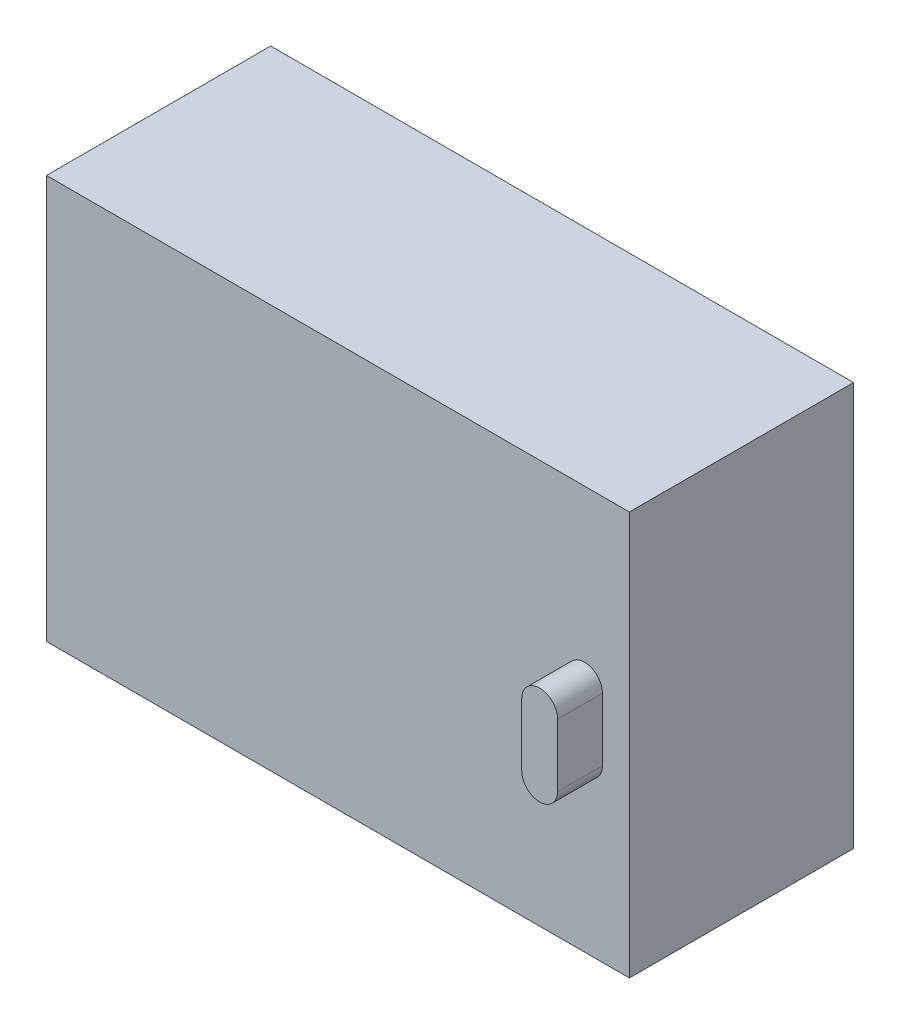
ISO-10303-21;
HEADER;
FILE_DESCRIPTION(('STEP AP214'),'2;1');
FILE_NAME('part.step','',(''),(''),'','','');
FILE_SCHEMA(('AUTOMOTIVE_DESIGN { 1 0 10303 214 1 1 1 1 }'));
ENDSEC;
DATA;
#1=APPLICATION_CONTEXT('core data for automotive mechanical design processes');
#2=APPLICATION_PROTOCOL_DEFINITION('international standard','automotive_design',2000,#1);
#3=PRODUCT_CONTEXT('',#1,'mechanical');
#4=PRODUCT('Part','Part','',(#3));
#5=PRODUCT_RELATED_PRODUCT_CATEGORY('part','',(#4));
#6=PRODUCT_DEFINITION_FORMATION('','',#4);
#7=PRODUCT_DEFINITION_CONTEXT('part definition',#1,'design');
#8=PRODUCT_DEFINITION('design','',#6,#7);
#9=PRODUCT_DEFINITION_SHAPE('','',#8);
#10=(LENGTH_UNIT() NAMED_UNIT(*) SI_UNIT(.MILLI.,.METRE.));
#11=(NAMED_UNIT(*) PLANE_ANGLE_UNIT() SI_UNIT($,.RADIAN.));
#12=(NAMED_UNIT(*) SI_UNIT($,.STERADIAN.) SOLID_ANGLE_UNIT());
#13=UNCERTAINTY_MEASURE_WITH_UNIT(LENGTH_MEASURE(1.E-05),#10,'distance_accuracy_value','');
#14=(GEOMETRIC_REPRESENTATION_CONTEXT(3) GLOBAL_UNCERTAINTY_ASSIGNED_CONTEXT((#13)) GLOBAL_UNIT_ASSIGNED_CONTEXT((#10,
#11,#12)) REPRESENTATION_CONTEXT('',''));
#15=CARTESIAN_POINT('',(0.,0.,0.));
#16=DIRECTION('',(0.,0.,1.));
#17=DIRECTION('',(1.,0.,0.));
#18=AXIS2_PLACEMENT_3D('',#15,#16,#17);
#19=CARTESIAN_POINT('',(-130.,0.,0.));
#20=DIRECTION('',(0.,0.,1.));
#21=DIRECTION('',(1.,0.,0.));
#22=AXIS2_PLACEMENT_3D('',#19,#20,#21);
#23=PLANE('',#22);
#24=DIRECTION('',(0.,-1.,0.));
#25=VECTOR('',#24,1.);
#26=CARTESIAN_POINT('',(0.,0.,0.));
#27=LINE('',#26,#25);
#28=CARTESIAN_POINT('',(0.,90.,0.));
#29=VERTEX_POINT('',#28);
#30=CARTESIAN_POINT('',(0.,0.,0.));
#31=VERTEX_POINT('',#30);
#32=EDGE_CURVE('E142',#29,#31,#27,.T.);
#33=ORIENTED_EDGE('',*,*,#32,.F.);
#34=DIRECTION('',(1.,0.,0.));
#35=VECTOR('',#34,1.);
#36=CARTESIAN_POINT('',(-130.,90.,0.));
#37=LINE('',#36,#35);
#38=CARTESIAN_POINT('',(-130.,90.,0.));
#39=VERTEX_POINT('',#38);
#40=EDGE_CURVE('E42',#39,#29,#37,.T.);
#41=ORIENTED_EDGE('',*,*,#40,.F.);
#42=DIRECTION('',(0.,-1.,0.));
#43=VECTOR('',#42,1.);
#44=CARTESIAN_POINT('',(-130.,0.,0.));
#45=LINE('',#44,#43);
#46=CARTESIAN_POINT('',(-130.,0.,0.));
#47=VERTEX_POINT('',#46);
#48=EDGE_CURVE('E147',#39,#47,#45,.T.);
#49=ORIENTED_EDGE('',*,*,#48,.T.);
#50=DIRECTION('',(1.,0.,0.));
#51=VECTOR('',#50,1.);
#52=CARTESIAN_POINT('',(-130.,0.,0.));
#53=LINE('',#52,#51);
#54=EDGE_CURVE('E11',#47,#31,#53,.T.);
#55=ORIENTED_EDGE('',*,*,#54,.T.);
#56=EDGE_LOOP('',(#33,#41,#49,#55));
#57=FACE_BOUND('',#56,.T.);
#58=DIRECTION('',(0.,1.,0.));
#59=VECTOR('',#58,1.);
#60=CARTESIAN_POINT('',(-6.00000000000001,38.,0.));
#61=LINE('',#60,#59);
#62=CARTESIAN_POINT('',(-6.00000000000001,38.,0.));
#63=VERTEX_POINT('',#62);
#64=CARTESIAN_POINT('',(-6.00000000000001,52.,0.));
#65=VERTEX_POINT('',#64);
#66=EDGE_CURVE('E257',#63,#65,#61,.T.);
#67=ORIENTED_EDGE('',*,*,#66,.F.);
#68=CARTESIAN_POINT('',(-10.,38.,0.));
#69=DIRECTION('',(0.,0.,1.));
#70=DIRECTION('',(1.,0.,0.));
#71=AXIS2_PLACEMENT_3D('',#68,#69,#70);
#72=CIRCLE('',#71,4.);
#73=CARTESIAN_POINT('',(-14.,38.,0.));
#74=VERTEX_POINT('',#73);
#75=EDGE_CURVE('E129',#74,#63,#72,.T.);
#76=ORIENTED_EDGE('',*,*,#75,.F.);
#77=DIRECTION('',(0.,-1.,0.));
#78=VECTOR('',#77,1.);
#79=CARTESIAN_POINT('',(-14.,38.,0.));
#80=LINE('',#79,#78);
#81=CARTESIAN_POINT('',(-14.,52.,0.));
#82=VERTEX_POINT('',#81);
#83=EDGE_CURVE('E125',#82,#74,#80,.T.);
#84=ORIENTED_EDGE('',*,*,#83,.F.);
#85=CARTESIAN_POINT('',(-10.,52.,0.));
#86=DIRECTION('',(0.,0.,1.));
#87=DIRECTION('',(1.,0.,0.));
#88=AXIS2_PLACEMENT_3D('',#85,#86,#87);
#89=CIRCLE('',#88,4.);
#90=EDGE_CURVE('E254',#65,#82,#89,.T.);
#91=ORIENTED_EDGE('',*,*,#90,.F.);
#92=EDGE_LOOP('',(#67,#76,#84,#91));
#93=FACE_BOUND('',#92,.T.);
#94=ADVANCED_FACE('F33',(#57,#93),#23,.T.);
#95=CARTESIAN_POINT('',(-130.,0.,-50.));
#96=DIRECTION('',(0.,-1.,0.));
#97=DIRECTION('',(0.,0.,-1.));
#98=AXIS2_PLACEMENT_3D('',#95,#96,#97);
#99=PLANE('',#98);
#100=DIRECTION('',(0.,0.,-1.));
#101=VECTOR('',#100,1.);
#102=CARTESIAN_POINT('',(0.,0.,-50.));
#103=LINE('',#102,#101);
#104=CARTESIAN_POINT('',(0.,0.,-50.));
#105=VERTEX_POINT('',#104);
#106=EDGE_CURVE('E131',#31,#105,#103,.T.);
#107=ORIENTED_EDGE('',*,*,#106,.F.);
#108=ORIENTED_EDGE('',*,*,#54,.F.);
#109=DIRECTION('',(0.,0.,-1.));
#110=VECTOR('',#109,1.);
#111=CARTESIAN_POINT('',(-130.,0.,-50.));
#112=LINE('',#111,#110);
#113=CARTESIAN_POINT('',(-130.,0.,-50.));
#114=VERTEX_POINT('',#113);
#115=EDGE_CURVE('E139',#47,#114,#112,.T.);
#116=ORIENTED_EDGE('',*,*,#115,.T.);
#117=DIRECTION('',(1.,0.,0.));
#118=VECTOR('',#117,1.);
#119=CARTESIAN_POINT('',(-130.,0.,-50.));
#120=LINE('',#119,#118);
#121=EDGE_CURVE('E37',#114,#105,#120,.T.);
#122=ORIENTED_EDGE('',*,*,#121,.T.);
#123=EDGE_LOOP('',(#107,#108,#116,#122));
#124=FACE_BOUND('',#123,.T.);
#125=ADVANCED_FACE('F35',(#124),#99,.T.);
#126=CARTESIAN_POINT('',(-130.,90.,0.));
#127=DIRECTION('',(0.,1.,0.));
#128=DIRECTION('',(0.,0.,1.));
#129=AXIS2_PLACEMENT_3D('',#126,#127,#128);
#130=PLANE('',#129);
#131=DIRECTION('',(0.,0.,1.));
#132=VECTOR('',#131,1.);
#133=CARTESIAN_POINT('',(0.,90.,0.));
#134=LINE('',#133,#132);
#135=CARTESIAN_POINT('',(0.,90.,-50.));
#136=VERTEX_POINT('',#135);
#137=EDGE_CURVE('E151',#136,#29,#134,.T.);
#138=ORIENTED_EDGE('',*,*,#137,.F.);
#139=DIRECTION('',(1.,0.,0.));
#140=VECTOR('',#139,1.);
#141=CARTESIAN_POINT('',(-130.,90.,-50.));
#142=LINE('',#141,#140);
#143=CARTESIAN_POINT('',(-130.,90.,-50.));
#144=VERTEX_POINT('',#143);
#145=EDGE_CURVE('E156',#144,#136,#142,.T.);
#146=ORIENTED_EDGE('',*,*,#145,.F.);
#147=DIRECTION('',(0.,0.,1.));
#148=VECTOR('',#147,1.);
#149=CARTESIAN_POINT('',(-130.,90.,0.));
#150=LINE('',#149,#148);
#151=EDGE_CURVE('E144',#144,#39,#150,.T.);
#152=ORIENTED_EDGE('',*,*,#151,.T.);
#153=ORIENTED_EDGE('',*,*,#40,.T.);
#154=EDGE_LOOP('',(#138,#146,#152,#153));
#155=FACE_BOUND('',#154,.T.);
#156=ADVANCED_FACE('F165',(#155),#130,.T.);
#157=CARTESIAN_POINT('',(-130.,90.,-50.));
#158=DIRECTION('',(0.,0.,-1.));
#159=DIRECTION('',(-1.,0.,0.));
#160=AXIS2_PLACEMENT_3D('',#157,#158,#159);
#161=PLANE('',#160);
#162=DIRECTION('',(0.,1.,0.));
#163=VECTOR('',#162,1.);
#164=CARTESIAN_POINT('',(0.,90.,-50.));
#165=LINE('',#164,#163);
#166=EDGE_CURVE('E134',#105,#136,#165,.T.);
#167=ORIENTED_EDGE('',*,*,#166,.F.);
#168=ORIENTED_EDGE('',*,*,#121,.F.);
#169=DIRECTION('',(0.,1.,0.));
#170=VECTOR('',#169,1.);
#171=CARTESIAN_POINT('',(-130.,90.,-50.));
#172=LINE('',#171,#170);
#173=EDGE_CURVE('E141',#114,#144,#172,.T.);
#174=ORIENTED_EDGE('',*,*,#173,.T.);
#175=ORIENTED_EDGE('',*,*,#145,.T.);
#176=EDGE_LOOP('',(#167,#168,#174,#175));
#177=FACE_BOUND('',#176,.T.);
#178=ADVANCED_FACE('F158',(#177),#161,.T.);
#179=CARTESIAN_POINT('',(-130.,0.,0.));
#180=DIRECTION('',(-1.,0.,0.));
#181=DIRECTION('',(0.,0.,1.));
#182=AXIS2_PLACEMENT_3D('',#179,#180,#181);
#183=PLANE('',#182);
#184=ORIENTED_EDGE('',*,*,#115,.F.);
#185=ORIENTED_EDGE('',*,*,#48,.F.);
#186=ORIENTED_EDGE('',*,*,#151,.F.);
#187=ORIENTED_EDGE('',*,*,#173,.F.);
#188=EDGE_LOOP('',(#184,#185,#186,#187));
#189=FACE_BOUND('',#188,.T.);
#190=ADVANCED_FACE('F167',(#189),#183,.T.);
#191=CARTESIAN_POINT('',(0.,0.,0.));
#192=DIRECTION('',(-1.,0.,0.));
#193=DIRECTION('',(0.,0.,1.));
#194=AXIS2_PLACEMENT_3D('',#191,#192,#193);
#195=PLANE('',#194);
#196=ORIENTED_EDGE('',*,*,#106,.T.);
#197=ORIENTED_EDGE('',*,*,#166,.T.);
#198=ORIENTED_EDGE('',*,*,#137,.T.);
#199=ORIENTED_EDGE('',*,*,#32,.T.);
#200=EDGE_LOOP('',(#196,#197,#198,#199));
#201=FACE_BOUND('',#200,.T.);
#202=ADVANCED_FACE('F160',(#201),#195,.F.);
#203=CARTESIAN_POINT('',(-10.,38.,10.));
#204=DIRECTION('',(0.,0.,-1.));
#205=DIRECTION('',(-1.,0.,0.));
#206=AXIS2_PLACEMENT_3D('',#203,#204,#205);
#207=CYLINDRICAL_SURFACE('',#206,4.);
#208=ORIENTED_EDGE('',*,*,#75,.T.);
#209=DIRECTION('',(0.,0.,-1.));
#210=VECTOR('',#209,1.);
#211=CARTESIAN_POINT('',(-6.00000000000001,38.,10.));
#212=LINE('',#211,#210);
#213=CARTESIAN_POINT('',(-6.00000000000001,38.,10.));
#214=VERTEX_POINT('',#213);
#215=EDGE_CURVE('E110',#214,#63,#212,.T.);
#216=ORIENTED_EDGE('',*,*,#215,.F.);
#217=CARTESIAN_POINT('',(-10.,38.,10.));
#218=DIRECTION('',(0.,0.,1.));
#219=DIRECTION('',(1.,0.,0.));
#220=AXIS2_PLACEMENT_3D('',#217,#218,#219);
#221=CIRCLE('',#220,4.);
#222=CARTESIAN_POINT('',(-14.,38.,10.));
#223=VERTEX_POINT('',#222);
#224=EDGE_CURVE('E117',#223,#214,#221,.T.);
#225=ORIENTED_EDGE('',*,*,#224,.F.);
#226=DIRECTION('',(0.,0.,-1.));
#227=VECTOR('',#226,1.);
#228=CARTESIAN_POINT('',(-14.,38.,10.));
#229=LINE('',#228,#227);
#230=EDGE_CURVE('E252',#223,#74,#229,.T.);
#231=ORIENTED_EDGE('',*,*,#230,.T.);
#232=EDGE_LOOP('',(#208,#216,#225,#231));
#233=FACE_BOUND('',#232,.T.);
#234=ADVANCED_FACE('F127',(#233),#207,.T.);
#235=CARTESIAN_POINT('',(-6.00000000000001,38.,10.));
#236=DIRECTION('',(-1.,0.,0.));
#237=DIRECTION('',(0.,0.,1.));
#238=AXIS2_PLACEMENT_3D('',#235,#236,#237);
#239=PLANE('',#238);
#240=ORIENTED_EDGE('',*,*,#66,.T.);
#241=DIRECTION('',(0.,0.,-1.));
#242=VECTOR('',#241,1.);
#243=CARTESIAN_POINT('',(-6.00000000000001,52.,10.));
#244=LINE('',#243,#242);
#245=CARTESIAN_POINT('',(-6.00000000000001,52.,10.));
#246=VERTEX_POINT('',#245);
#247=EDGE_CURVE('E113',#246,#65,#244,.T.);
#248=ORIENTED_EDGE('',*,*,#247,.F.);
#249=DIRECTION('',(0.,1.,0.));
#250=VECTOR('',#249,1.);
#251=CARTESIAN_POINT('',(-6.00000000000001,38.,10.));
#252=LINE('',#251,#250);
#253=EDGE_CURVE('E106',#214,#246,#252,.T.);
#254=ORIENTED_EDGE('',*,*,#253,.F.);
#255=ORIENTED_EDGE('',*,*,#215,.T.);
#256=EDGE_LOOP('',(#240,#248,#254,#255));
#257=FACE_BOUND('',#256,.T.);
#258=ADVANCED_FACE('F108',(#257),#239,.F.);
#259=CARTESIAN_POINT('',(-10.,52.,10.));
#260=DIRECTION('',(0.,0.,-1.));
#261=DIRECTION('',(-1.,0.,0.));
#262=AXIS2_PLACEMENT_3D('',#259,#260,#261);
#263=CYLINDRICAL_SURFACE('',#262,4.);
#264=ORIENTED_EDGE('',*,*,#90,.T.);
#265=DIRECTION('',(0.,0.,-1.));
#266=VECTOR('',#265,1.);
#267=CARTESIAN_POINT('',(-14.,52.,10.));
#268=LINE('',#267,#266);
#269=CARTESIAN_POINT('',(-14.,52.,10.));
#270=VERTEX_POINT('',#269);
#271=EDGE_CURVE('E50',#270,#82,#268,.T.);
#272=ORIENTED_EDGE('',*,*,#271,.F.);
#273=CARTESIAN_POINT('',(-10.,52.,10.));
#274=DIRECTION('',(0.,0.,1.));
#275=DIRECTION('',(1.,0.,0.));
#276=AXIS2_PLACEMENT_3D('',#273,#274,#275);
#277=CIRCLE('',#276,4.);
#278=EDGE_CURVE('E116',#246,#270,#277,.T.);
#279=ORIENTED_EDGE('',*,*,#278,.F.);
#280=ORIENTED_EDGE('',*,*,#247,.T.);
#281=EDGE_LOOP('',(#264,#272,#279,#280));
#282=FACE_BOUND('',#281,.T.);
#283=ADVANCED_FACE('F221',(#282),#263,.T.);
#284=CARTESIAN_POINT('',(-14.,38.,10.));
#285=DIRECTION('',(1.,0.,0.));
#286=DIRECTION('',(0.,0.,-1.));
#287=AXIS2_PLACEMENT_3D('',#284,#285,#286);
#288=PLANE('',#287);
#289=ORIENTED_EDGE('',*,*,#83,.T.);
#290=ORIENTED_EDGE('',*,*,#230,.F.);
#291=DIRECTION('',(0.,-1.,0.));
#292=VECTOR('',#291,1.);
#293=CARTESIAN_POINT('',(-14.,38.,10.));
#294=LINE('',#293,#292);
#295=EDGE_CURVE('E121',#270,#223,#294,.T.);
#296=ORIENTED_EDGE('',*,*,#295,.F.);
#297=ORIENTED_EDGE('',*,*,#271,.T.);
#298=EDGE_LOOP('',(#289,#290,#296,#297));
#299=FACE_BOUND('',#298,.T.);
#300=ADVANCED_FACE('F230',(#299),#288,.F.);
#301=CARTESIAN_POINT('',(-10.,38.,10.));
#302=DIRECTION('',(0.,0.,1.));
#303=DIRECTION('',(1.,0.,0.));
#304=AXIS2_PLACEMENT_3D('',#301,#302,#303);
#305=PLANE('',#304);
#306=ORIENTED_EDGE('',*,*,#224,.T.);
#307=ORIENTED_EDGE('',*,*,#253,.T.);
#308=ORIENTED_EDGE('',*,*,#278,.T.);
#309=ORIENTED_EDGE('',*,*,#295,.T.);
#310=EDGE_LOOP('',(#306,#307,#308,#309));
#311=FACE_BOUND('',#310,.T.);
#312=ADVANCED_FACE('F120',(#311),#305,.T.);
#313=CLOSED_SHELL('',(#94,#125,#156,#178,#190,#202,#234,#258,#283,#300,#312));
#314=MANIFOLD_SOLID_BREP('B2',#313);
#315=ADVANCED_BREP_SHAPE_REPRESENTATION('',(#18,#314),#14);
#316=SHAPE_DEFINITION_REPRESENTATION(#9,#315);
ENDSEC;
END-ISO-10303-21;
